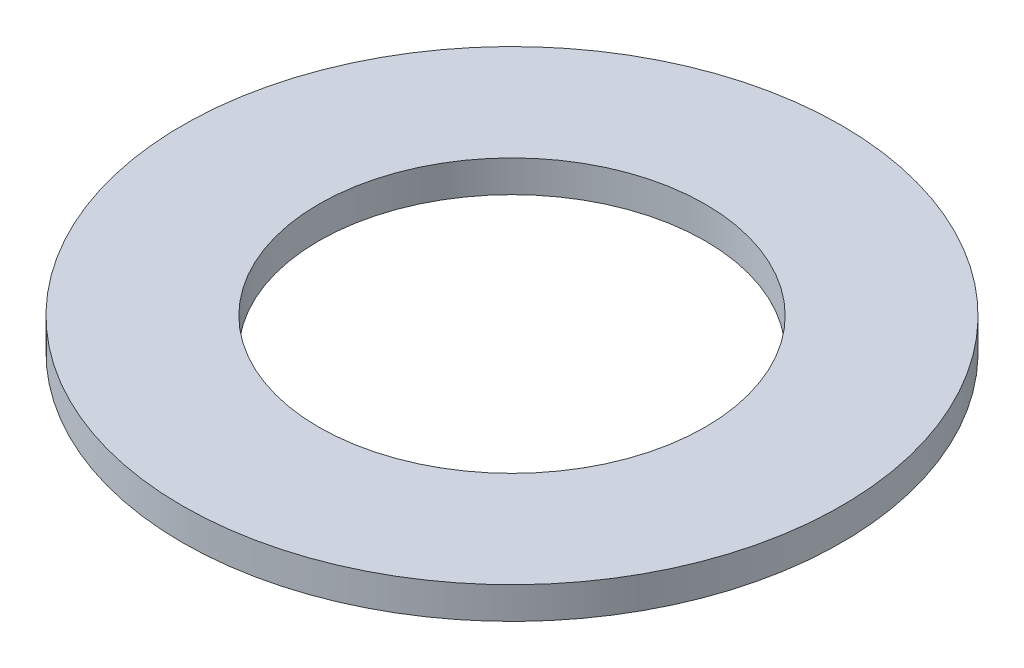
ISO-10303-21;
HEADER;
FILE_DESCRIPTION(('STEP AP214'),'2;1');
FILE_NAME('part.step','',(''),(''),'','','');
FILE_SCHEMA(('AUTOMOTIVE_DESIGN { 1 0 10303 214 1 1 1 1 }'));
ENDSEC;
DATA;
#1=APPLICATION_CONTEXT('core data for automotive mechanical design processes');
#2=APPLICATION_PROTOCOL_DEFINITION('international standard','automotive_design',2000,#1);
#3=PRODUCT_CONTEXT('',#1,'mechanical');
#4=PRODUCT('Part','Part','',(#3));
#5=PRODUCT_RELATED_PRODUCT_CATEGORY('part','',(#4));
#6=PRODUCT_DEFINITION_FORMATION('','',#4);
#7=PRODUCT_DEFINITION_CONTEXT('part definition',#1,'design');
#8=PRODUCT_DEFINITION('design','',#6,#7);
#9=PRODUCT_DEFINITION_SHAPE('','',#8);
#10=(LENGTH_UNIT() NAMED_UNIT(*) SI_UNIT(.MILLI.,.METRE.));
#11=(NAMED_UNIT(*) PLANE_ANGLE_UNIT() SI_UNIT($,.RADIAN.));
#12=(NAMED_UNIT(*) SI_UNIT($,.STERADIAN.) SOLID_ANGLE_UNIT());
#13=UNCERTAINTY_MEASURE_WITH_UNIT(LENGTH_MEASURE(1.E-05),#10,'distance_accuracy_value','');
#14=(GEOMETRIC_REPRESENTATION_CONTEXT(3) GLOBAL_UNCERTAINTY_ASSIGNED_CONTEXT((#13)) GLOBAL_UNIT_ASSIGNED_CONTEXT((#10,
#11,#12)) REPRESENTATION_CONTEXT('',''));
#15=CARTESIAN_POINT('',(0.,0.,0.));
#16=DIRECTION('',(0.,0.,1.));
#17=DIRECTION('',(1.,0.,0.));
#18=AXIS2_PLACEMENT_3D('',#15,#16,#17);
#19=CARTESIAN_POINT('',(0.,7.,0.));
#20=DIRECTION('',(0.,-1.,0.));
#21=DIRECTION('',(0.,0.,-1.));
#22=AXIS2_PLACEMENT_3D('',#19,#20,#21);
#23=CYLINDRICAL_SURFACE('',#22,72.5);
#24=CARTESIAN_POINT('',(0.,7.,0.));
#25=DIRECTION('',(0.,1.,0.));
#26=DIRECTION('',(0.,0.,1.));
#27=AXIS2_PLACEMENT_3D('',#24,#25,#26);
#28=CIRCLE('',#27,72.5);
#29=CARTESIAN_POINT('',(0.,7.,72.5));
#30=VERTEX_POINT('',#29);
#31=EDGE_CURVE('E10',#30,#30,#28,.T.);
#32=ORIENTED_EDGE('',*,*,#31,.F.);
#33=EDGE_LOOP('',(#32));
#34=FACE_BOUND('',#33,.T.);
#35=CARTESIAN_POINT('',(0.,0.,0.));
#36=DIRECTION('',(0.,1.,0.));
#37=DIRECTION('',(0.,0.,1.));
#38=AXIS2_PLACEMENT_3D('',#35,#36,#37);
#39=CIRCLE('',#38,72.5);
#40=CARTESIAN_POINT('',(0.,0.,72.5));
#41=VERTEX_POINT('',#40);
#42=EDGE_CURVE('E37',#41,#41,#39,.T.);
#43=ORIENTED_EDGE('',*,*,#42,.T.);
#44=EDGE_LOOP('',(#43));
#45=FACE_BOUND('',#44,.T.);
#46=ADVANCED_FACE('F40',(#34,#45),#23,.T.);
#47=CARTESIAN_POINT('',(0.,7.,0.));
#48=DIRECTION('',(0.,1.,0.));
#49=DIRECTION('',(0.,0.,1.));
#50=AXIS2_PLACEMENT_3D('',#47,#48,#49);
#51=PLANE('',#50);
#52=CARTESIAN_POINT('',(0.,7.,0.));
#53=DIRECTION('',(0.,1.,0.));
#54=DIRECTION('',(0.,0.,1.));
#55=AXIS2_PLACEMENT_3D('',#52,#53,#54);
#56=CIRCLE('',#55,42.5);
#57=CARTESIAN_POINT('',(0.,7.,42.5));
#58=VERTEX_POINT('',#57);
#59=EDGE_CURVE('E50',#58,#58,#56,.T.);
#60=ORIENTED_EDGE('',*,*,#59,.F.);
#61=EDGE_LOOP('',(#60));
#62=FACE_BOUND('',#61,.T.);
#63=ORIENTED_EDGE('',*,*,#31,.T.);
#64=EDGE_LOOP('',(#63));
#65=FACE_BOUND('',#64,.T.);
#66=ADVANCED_FACE('F59',(#62,#65),#51,.T.);
#67=CARTESIAN_POINT('',(0.,0.,0.));
#68=DIRECTION('',(0.,1.,0.));
#69=DIRECTION('',(0.,0.,1.));
#70=AXIS2_PLACEMENT_3D('',#67,#68,#69);
#71=PLANE('',#70);
#72=CARTESIAN_POINT('',(0.,0.,0.));
#73=DIRECTION('',(0.,1.,0.));
#74=DIRECTION('',(0.,0.,1.));
#75=AXIS2_PLACEMENT_3D('',#72,#73,#74);
#76=CIRCLE('',#75,42.5);
#77=CARTESIAN_POINT('',(0.,0.,42.5));
#78=VERTEX_POINT('',#77);
#79=EDGE_CURVE('E47',#78,#78,#76,.T.);
#80=ORIENTED_EDGE('',*,*,#79,.T.);
#81=EDGE_LOOP('',(#80));
#82=FACE_BOUND('',#81,.T.);
#83=ORIENTED_EDGE('',*,*,#42,.F.);
#84=EDGE_LOOP('',(#83));
#85=FACE_BOUND('',#84,.T.);
#86=ADVANCED_FACE('F58',(#82,#85),#71,.F.);
#87=CARTESIAN_POINT('',(0.,7.,0.));
#88=DIRECTION('',(0.,-1.,0.));
#89=DIRECTION('',(0.,0.,-1.));
#90=AXIS2_PLACEMENT_3D('',#87,#88,#89);
#91=CYLINDRICAL_SURFACE('',#90,42.5);
#92=ORIENTED_EDGE('',*,*,#59,.T.);
#93=EDGE_LOOP('',(#92));
#94=FACE_BOUND('',#93,.T.);
#95=ORIENTED_EDGE('',*,*,#79,.F.);
#96=EDGE_LOOP('',(#95));
#97=FACE_BOUND('',#96,.T.);
#98=ADVANCED_FACE('F54',(#94,#97),#91,.F.);
#99=CLOSED_SHELL('',(#46,#66,#86,#98));
#100=MANIFOLD_SOLID_BREP('B2',#99);
#101=ADVANCED_BREP_SHAPE_REPRESENTATION('',(#18,#100),#14);
#102=SHAPE_DEFINITION_REPRESENTATION(#9,#101);
ENDSEC;
END-ISO-10303-21;
